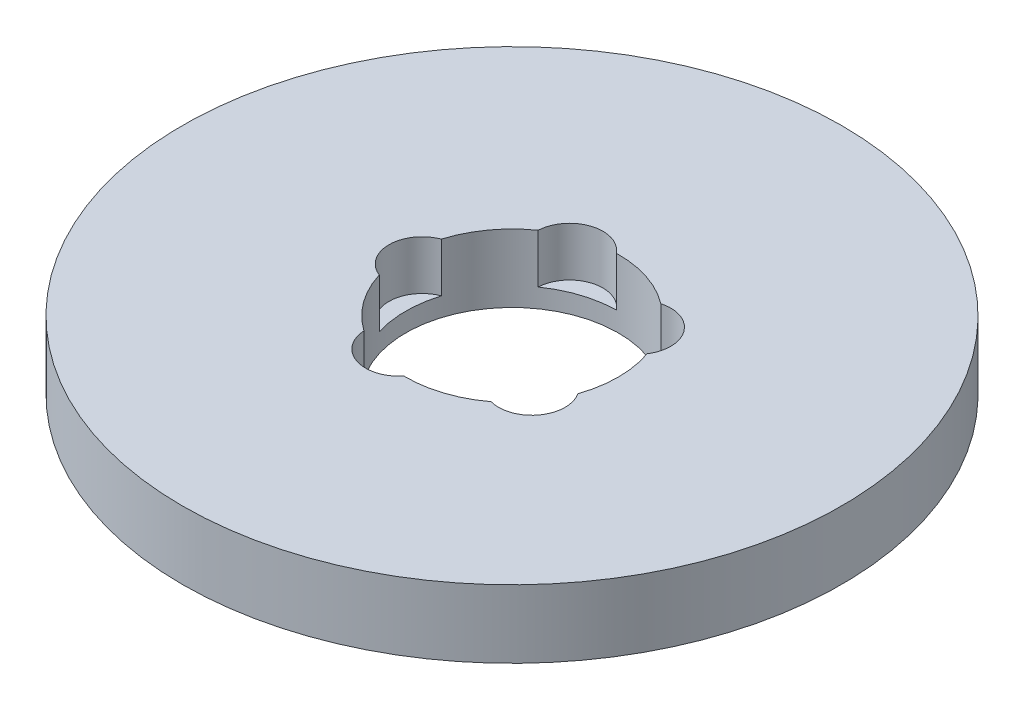
ISO-10303-21;
HEADER;
FILE_DESCRIPTION(('STEP AP214'),'2;1');
FILE_NAME('part.step','',(''),(''),'','','');
FILE_SCHEMA(('AUTOMOTIVE_DESIGN { 1 0 10303 214 1 1 1 1 }'));
ENDSEC;
DATA;
#1=APPLICATION_CONTEXT('core data for automotive mechanical design processes');
#2=APPLICATION_PROTOCOL_DEFINITION('international standard','automotive_design',2000,#1);
#3=PRODUCT_CONTEXT('',#1,'mechanical');
#4=PRODUCT('Part','Part','',(#3));
#5=PRODUCT_RELATED_PRODUCT_CATEGORY('part','',(#4));
#6=PRODUCT_DEFINITION_FORMATION('','',#4);
#7=PRODUCT_DEFINITION_CONTEXT('part definition',#1,'design');
#8=PRODUCT_DEFINITION('design','',#6,#7);
#9=PRODUCT_DEFINITION_SHAPE('','',#8);
#10=(LENGTH_UNIT() NAMED_UNIT(*) SI_UNIT(.MILLI.,.METRE.));
#11=(NAMED_UNIT(*) PLANE_ANGLE_UNIT() SI_UNIT($,.RADIAN.));
#12=(NAMED_UNIT(*) SI_UNIT($,.STERADIAN.) SOLID_ANGLE_UNIT());
#13=UNCERTAINTY_MEASURE_WITH_UNIT(LENGTH_MEASURE(1.E-05),#10,'distance_accuracy_value','');
#14=(GEOMETRIC_REPRESENTATION_CONTEXT(3) GLOBAL_UNCERTAINTY_ASSIGNED_CONTEXT((#13)) GLOBAL_UNIT_ASSIGNED_CONTEXT((#10,
#11,#12)) REPRESENTATION_CONTEXT('',''));
#15=CARTESIAN_POINT('',(0.,0.,0.));
#16=DIRECTION('',(0.,0.,1.));
#17=DIRECTION('',(1.,0.,0.));
#18=AXIS2_PLACEMENT_3D('',#15,#16,#17);
#19=CARTESIAN_POINT('',(0.,16.,0.));
#20=DIRECTION('',(0.,-1.,0.));
#21=DIRECTION('',(0.,0.,-1.));
#22=AXIS2_PLACEMENT_3D('',#19,#20,#21);
#23=CYLINDRICAL_SURFACE('',#22,77.5);
#24=CARTESIAN_POINT('',(0.,16.,0.));
#25=DIRECTION('',(0.,1.,0.));
#26=DIRECTION('',(0.,0.,1.));
#27=AXIS2_PLACEMENT_3D('',#24,#25,#26);
#28=CIRCLE('',#27,77.5);
#29=CARTESIAN_POINT('',(0.,16.,77.5));
#30=VERTEX_POINT('',#29);
#31=EDGE_CURVE('E151',#30,#30,#28,.T.);
#32=ORIENTED_EDGE('',*,*,#31,.F.);
#33=EDGE_LOOP('',(#32));
#34=FACE_BOUND('',#33,.T.);
#35=CARTESIAN_POINT('',(0.,0.,0.));
#36=DIRECTION('',(0.,1.,0.));
#37=DIRECTION('',(0.,0.,1.));
#38=AXIS2_PLACEMENT_3D('',#35,#36,#37);
#39=CIRCLE('',#38,77.5);
#40=CARTESIAN_POINT('',(0.,0.,77.5));
#41=VERTEX_POINT('',#40);
#42=EDGE_CURVE('E150',#41,#41,#39,.T.);
#43=ORIENTED_EDGE('',*,*,#42,.T.);
#44=EDGE_LOOP('',(#43));
#45=FACE_BOUND('',#44,.T.);
#46=ADVANCED_FACE('F39',(#34,#45),#23,.T.);
#47=CARTESIAN_POINT('',(0.,16.,0.));
#48=DIRECTION('',(0.,1.,0.));
#49=DIRECTION('',(0.,0.,1.));
#50=AXIS2_PLACEMENT_3D('',#47,#48,#49);
#51=PLANE('',#50);
#52=CARTESIAN_POINT('',(-6.52725455077584,16.,-20.0888238738743));
#53=DIRECTION('',(0.,1.,0.));
#54=DIRECTION('',(-0.95105651629515,0.,0.309016994374958));
#55=AXIS2_PLACEMENT_3D('',#52,#53,#54);
#56=CIRCLE('',#55,7.81487325369595);
#57=CARTESIAN_POINT('',(-0.445189525537201,16.,-24.9960358114312));
#58=VERTEX_POINT('',#57);
#59=CARTESIAN_POINT('',(-14.3321353238569,16.,-20.4838936010382));
#60=VERTEX_POINT('',#59);
#61=EDGE_CURVE('E196',#58,#60,#56,.T.);
#62=ORIENTED_EDGE('',*,*,#61,.F.);
#63=CARTESIAN_POINT('',(0.,16.,0.));
#64=DIRECTION('',(0.,1.,0.));
#65=DIRECTION('',(0.,0.,1.));
#66=AXIS2_PLACEMENT_3D('',#63,#64,#65);
#67=CIRCLE('',#66,25.);
#68=CARTESIAN_POINT('',(15.0524671076107,16.,-19.9605419258671));
#69=VERTEX_POINT('',#68);
#70=EDGE_CURVE('E156',#69,#58,#67,.T.);
#71=ORIENTED_EDGE('',*,*,#70,.F.);
#72=CARTESIAN_POINT('',(17.0885742671529,16.,-12.4155759480648));
#73=DIRECTION('',(0.,1.,0.));
#74=DIRECTION('',(-0.58778525229248,0.,-0.809016994374942));
#75=AXIS2_PLACEMENT_3D('',#72,#73,#74);
#76=CIRCLE('',#75,7.81487325369595);
#77=CARTESIAN_POINT('',(23.6350716109,16.,-8.14760025698547));
#78=VERTEX_POINT('',#77);
#79=EDGE_CURVE('E254',#78,#69,#76,.T.);
#80=ORIENTED_EDGE('',*,*,#79,.F.);
#81=CARTESIAN_POINT('',(23.6350716109001,16.,8.14760025698513));
#82=VERTEX_POINT('',#81);
#83=EDGE_CURVE('E153',#82,#78,#67,.T.);
#84=ORIENTED_EDGE('',*,*,#83,.F.);
#85=CARTESIAN_POINT('',(17.0885742671531,16.,12.4155759480646));
#86=DIRECTION('',(0.,1.,0.));
#87=DIRECTION('',(0.587785252292469,0.,-0.809016994374951));
#88=AXIS2_PLACEMENT_3D('',#85,#86,#87);
#89=CIRCLE('',#88,7.81487325369595);
#90=CARTESIAN_POINT('',(15.052467107611,16.,19.9605419258669));
#91=VERTEX_POINT('',#90);
#92=EDGE_CURVE('E248',#91,#82,#89,.T.);
#93=ORIENTED_EDGE('',*,*,#92,.F.);
#94=CARTESIAN_POINT('',(-0.445189525536845,16.,24.9960358114312));
#95=VERTEX_POINT('',#94);
#96=EDGE_CURVE('E140',#95,#91,#67,.T.);
#97=ORIENTED_EDGE('',*,*,#96,.F.);
#98=CARTESIAN_POINT('',(-6.52725455077556,16.,20.0888238738744));
#99=DIRECTION('',(0.,1.,0.));
#100=DIRECTION('',(0.951056516295155,0.,0.309016994374945));
#101=AXIS2_PLACEMENT_3D('',#98,#99,#100);
#102=CIRCLE('',#101,7.81487325369595);
#103=CARTESIAN_POINT('',(-14.3321353238567,16.,20.4838936010384));
#104=VERTEX_POINT('',#103);
#105=EDGE_CURVE('E117',#104,#95,#102,.T.);
#106=ORIENTED_EDGE('',*,*,#105,.F.);
#107=CARTESIAN_POINT('',(-23.9102138691173,16.,7.30079945848879));
#108=VERTEX_POINT('',#107);
#109=EDGE_CURVE('E133',#108,#104,#67,.T.);
#110=ORIENTED_EDGE('',*,*,#109,.F.);
#111=CARTESIAN_POINT('',(-21.1226394327547,16.,0.));
#112=DIRECTION('',(0.,1.,0.));
#113=DIRECTION('',(0.,0.,1.));
#114=AXIS2_PLACEMENT_3D('',#111,#112,#113);
#115=CIRCLE('',#114,7.81487325369595);
#116=CARTESIAN_POINT('',(-23.9102138691173,16.,-7.30079945848879));
#117=VERTEX_POINT('',#116);
#118=EDGE_CURVE('E170',#117,#108,#115,.T.);
#119=ORIENTED_EDGE('',*,*,#118,.F.);
#120=EDGE_CURVE('E149',#60,#117,#67,.T.);
#121=ORIENTED_EDGE('',*,*,#120,.F.);
#122=EDGE_LOOP('',(#62,#71,#80,#84,#93,#97,#106,#110,#119,#121));
#123=FACE_BOUND('',#122,.T.);
#124=ORIENTED_EDGE('',*,*,#31,.T.);
#125=EDGE_LOOP('',(#124));
#126=FACE_BOUND('',#125,.T.);
#127=ADVANCED_FACE('F131',(#123,#126),#51,.T.);
#128=CARTESIAN_POINT('',(0.,0.,0.));
#129=DIRECTION('',(0.,1.,0.));
#130=DIRECTION('',(0.,0.,1.));
#131=AXIS2_PLACEMENT_3D('',#128,#129,#130);
#132=PLANE('',#131);
#133=CARTESIAN_POINT('',(0.,0.,0.));
#134=DIRECTION('',(0.,1.,0.));
#135=DIRECTION('',(0.,0.,1.));
#136=AXIS2_PLACEMENT_3D('',#133,#134,#135);
#137=CIRCLE('',#136,25.);
#138=CARTESIAN_POINT('',(0.,0.,25.));
#139=VERTEX_POINT('',#138);
#140=EDGE_CURVE('E160',#139,#139,#137,.T.);
#141=ORIENTED_EDGE('',*,*,#140,.T.);
#142=EDGE_LOOP('',(#141));
#143=FACE_BOUND('',#142,.T.);
#144=ORIENTED_EDGE('',*,*,#42,.F.);
#145=EDGE_LOOP('',(#144));
#146=FACE_BOUND('',#145,.T.);
#147=ADVANCED_FACE('F212',(#143,#146),#132,.F.);
#148=CARTESIAN_POINT('',(0.,16.,0.));
#149=DIRECTION('',(0.,-1.,0.));
#150=DIRECTION('',(0.,0.,-1.));
#151=AXIS2_PLACEMENT_3D('',#148,#149,#150);
#152=CYLINDRICAL_SURFACE('',#151,25.);
#153=DIRECTION('',(0.,1.,0.));
#154=VECTOR('',#153,1.);
#155=CARTESIAN_POINT('',(-0.445189525537202,10.2204187529769,-24.9960358114312));
#156=LINE('',#155,#154);
#157=CARTESIAN_POINT('',(-0.445189525537201,4.44083750595388,-24.9960358114312));
#158=VERTEX_POINT('',#157);
#159=EDGE_CURVE('E11',#158,#58,#156,.T.);
#160=ORIENTED_EDGE('',*,*,#159,.F.);
#161=CARTESIAN_POINT('',(0.,4.44083750595388,0.));
#162=DIRECTION('',(0.,1.,0.));
#163=DIRECTION('',(0.,0.,1.));
#164=AXIS2_PLACEMENT_3D('',#161,#162,#163);
#165=CIRCLE('',#164,25.);
#166=CARTESIAN_POINT('',(-14.3321353238569,4.44083750595388,-20.4838936010382));
#167=VERTEX_POINT('',#166);
#168=EDGE_CURVE('E193',#158,#167,#165,.T.);
#169=ORIENTED_EDGE('',*,*,#168,.T.);
#170=DIRECTION('',(0.,1.,0.));
#171=VECTOR('',#170,1.);
#172=CARTESIAN_POINT('',(-14.3321353238569,10.2204187529769,-20.4838936010382));
#173=LINE('',#172,#171);
#174=EDGE_CURVE('E46',#60,#167,#173,.F.);
#175=ORIENTED_EDGE('',*,*,#174,.F.);
#176=ORIENTED_EDGE('',*,*,#120,.T.);
#177=DIRECTION('',(0.,1.,0.));
#178=VECTOR('',#177,1.);
#179=CARTESIAN_POINT('',(-23.9102138691173,10.2204187529769,-7.30079945848879));
#180=LINE('',#179,#178);
#181=CARTESIAN_POINT('',(-23.9102138691173,4.44083750595388,-7.30079945848879));
#182=VERTEX_POINT('',#181);
#183=EDGE_CURVE('E174',#182,#117,#180,.T.);
#184=ORIENTED_EDGE('',*,*,#183,.F.);
#185=CARTESIAN_POINT('',(0.,4.44083750595388,0.));
#186=DIRECTION('',(0.,1.,0.));
#187=DIRECTION('',(0.,0.,1.));
#188=AXIS2_PLACEMENT_3D('',#185,#186,#187);
#189=CIRCLE('',#188,25.);
#190=CARTESIAN_POINT('',(-23.9102138691173,4.44083750595388,7.30079945848879));
#191=VERTEX_POINT('',#190);
#192=EDGE_CURVE('E171',#182,#191,#189,.T.);
#193=ORIENTED_EDGE('',*,*,#192,.T.);
#194=DIRECTION('',(0.,1.,0.));
#195=VECTOR('',#194,1.);
#196=CARTESIAN_POINT('',(-23.9102138691173,10.2204187529769,7.30079945848879));
#197=LINE('',#196,#195);
#198=EDGE_CURVE('E148',#108,#191,#197,.F.);
#199=ORIENTED_EDGE('',*,*,#198,.F.);
#200=ORIENTED_EDGE('',*,*,#109,.T.);
#201=DIRECTION('',(0.,1.,0.));
#202=VECTOR('',#201,1.);
#203=CARTESIAN_POINT('',(-14.3321353238567,10.2204187529769,20.4838936010384));
#204=LINE('',#203,#202);
#205=CARTESIAN_POINT('',(-14.3321353238567,4.44083750595388,20.4838936010384));
#206=VERTEX_POINT('',#205);
#207=EDGE_CURVE('E111',#206,#104,#204,.T.);
#208=ORIENTED_EDGE('',*,*,#207,.F.);
#209=CARTESIAN_POINT('',(0.,4.44083750595388,0.));
#210=DIRECTION('',(0.,1.,0.));
#211=DIRECTION('',(0.,0.,1.));
#212=AXIS2_PLACEMENT_3D('',#209,#210,#211);
#213=CIRCLE('',#212,25.);
#214=CARTESIAN_POINT('',(-0.445189525536845,4.44083750595388,24.9960358114312));
#215=VERTEX_POINT('',#214);
#216=EDGE_CURVE('E180',#206,#215,#213,.T.);
#217=ORIENTED_EDGE('',*,*,#216,.T.);
#218=DIRECTION('',(0.,1.,0.));
#219=VECTOR('',#218,1.);
#220=CARTESIAN_POINT('',(-0.445189525536845,10.2204187529769,24.9960358114312));
#221=LINE('',#220,#219);
#222=EDGE_CURVE('E124',#95,#215,#221,.F.);
#223=ORIENTED_EDGE('',*,*,#222,.F.);
#224=ORIENTED_EDGE('',*,*,#96,.T.);
#225=DIRECTION('',(0.,1.,0.));
#226=VECTOR('',#225,1.);
#227=CARTESIAN_POINT('',(15.052467107611,10.2204187529769,19.9605419258669));
#228=LINE('',#227,#226);
#229=CARTESIAN_POINT('',(15.052467107611,4.44083750595388,19.9605419258669));
#230=VERTEX_POINT('',#229);
#231=EDGE_CURVE('E183',#230,#91,#228,.T.);
#232=ORIENTED_EDGE('',*,*,#231,.F.);
#233=CARTESIAN_POINT('',(0.,4.44083750595388,0.));
#234=DIRECTION('',(0.,1.,0.));
#235=DIRECTION('',(0.,0.,1.));
#236=AXIS2_PLACEMENT_3D('',#233,#234,#235);
#237=CIRCLE('',#236,25.);
#238=CARTESIAN_POINT('',(23.6350716109001,4.44083750595388,8.14760025698513));
#239=VERTEX_POINT('',#238);
#240=EDGE_CURVE('E123',#230,#239,#237,.T.);
#241=ORIENTED_EDGE('',*,*,#240,.T.);
#242=DIRECTION('',(0.,1.,0.));
#243=VECTOR('',#242,1.);
#244=CARTESIAN_POINT('',(23.6350716109001,10.2204187529769,8.14760025698513));
#245=LINE('',#244,#243);
#246=EDGE_CURVE('E185',#82,#239,#245,.F.);
#247=ORIENTED_EDGE('',*,*,#246,.F.);
#248=ORIENTED_EDGE('',*,*,#83,.T.);
#249=DIRECTION('',(0.,1.,0.));
#250=VECTOR('',#249,1.);
#251=CARTESIAN_POINT('',(23.6350716109,10.2204187529769,-8.14760025698547));
#252=LINE('',#251,#250);
#253=CARTESIAN_POINT('',(23.6350716109,4.44083750595388,-8.14760025698547));
#254=VERTEX_POINT('',#253);
#255=EDGE_CURVE('E195',#254,#78,#252,.T.);
#256=ORIENTED_EDGE('',*,*,#255,.F.);
#257=CARTESIAN_POINT('',(0.,4.44083750595388,0.));
#258=DIRECTION('',(0.,1.,0.));
#259=DIRECTION('',(0.,0.,1.));
#260=AXIS2_PLACEMENT_3D('',#257,#258,#259);
#261=CIRCLE('',#260,25.);
#262=CARTESIAN_POINT('',(15.0524671076107,4.44083750595388,-19.9605419258671));
#263=VERTEX_POINT('',#262);
#264=EDGE_CURVE('E190',#254,#263,#261,.T.);
#265=ORIENTED_EDGE('',*,*,#264,.T.);
#266=DIRECTION('',(0.,1.,0.));
#267=VECTOR('',#266,1.);
#268=CARTESIAN_POINT('',(15.0524671076107,10.2204187529769,-19.9605419258671));
#269=LINE('',#268,#267);
#270=EDGE_CURVE('E189',#69,#263,#269,.F.);
#271=ORIENTED_EDGE('',*,*,#270,.F.);
#272=ORIENTED_EDGE('',*,*,#70,.T.);
#273=EDGE_LOOP('',(#160,#169,#175,#176,#184,#193,#199,#200,#208,#217,#223,#224,#232,#241,#247,
#248,#256,#265,#271,#272));
#274=FACE_BOUND('',#273,.T.);
#275=ORIENTED_EDGE('',*,*,#140,.F.);
#276=EDGE_LOOP('',(#275));
#277=FACE_BOUND('',#276,.T.);
#278=ADVANCED_FACE('F142',(#274,#277),#152,.F.);
#279=CARTESIAN_POINT('',(-21.1226394327547,4.44083750595388,0.));
#280=DIRECTION('',(0.,1.,0.));
#281=DIRECTION('',(0.,0.,1.));
#282=AXIS2_PLACEMENT_3D('',#279,#280,#281);
#283=CYLINDRICAL_SURFACE('',#282,7.81487325369595);
#284=ORIENTED_EDGE('',*,*,#183,.T.);
#285=ORIENTED_EDGE('',*,*,#118,.T.);
#286=ORIENTED_EDGE('',*,*,#198,.T.);
#287=CARTESIAN_POINT('',(-21.1226394327547,4.44083750595388,0.));
#288=DIRECTION('',(0.,1.,0.));
#289=DIRECTION('',(0.,0.,1.));
#290=AXIS2_PLACEMENT_3D('',#287,#288,#289);
#291=CIRCLE('',#290,7.81487325369595);
#292=EDGE_CURVE('E163',#182,#191,#291,.T.);
#293=ORIENTED_EDGE('',*,*,#292,.F.);
#294=EDGE_LOOP('',(#284,#285,#286,#293));
#295=FACE_BOUND('',#294,.T.);
#296=ADVANCED_FACE('F221',(#295),#283,.F.);
#297=CARTESIAN_POINT('',(-21.1226394327547,4.44083750595388,0.));
#298=DIRECTION('',(0.,1.,0.));
#299=DIRECTION('',(0.,0.,1.));
#300=AXIS2_PLACEMENT_3D('',#297,#298,#299);
#301=PLANE('',#300);
#302=ORIENTED_EDGE('',*,*,#292,.T.);
#303=ORIENTED_EDGE('',*,*,#192,.F.);
#304=EDGE_LOOP('',(#302,#303));
#305=FACE_BOUND('',#304,.T.);
#306=ADVANCED_FACE('F227',(#305),#301,.T.);
#307=CARTESIAN_POINT('',(-6.52725455077556,4.44083750595388,20.0888238738744));
#308=DIRECTION('',(0.,1.,0.));
#309=DIRECTION('',(0.,0.,1.));
#310=AXIS2_PLACEMENT_3D('',#307,#308,#309);
#311=CYLINDRICAL_SURFACE('',#310,7.81487325369595);
#312=ORIENTED_EDGE('',*,*,#207,.T.);
#313=ORIENTED_EDGE('',*,*,#105,.T.);
#314=ORIENTED_EDGE('',*,*,#222,.T.);
#315=CARTESIAN_POINT('',(-6.52725455077556,4.44083750595388,20.0888238738744));
#316=DIRECTION('',(0.,1.,0.));
#317=DIRECTION('',(0.951056516295155,0.,0.309016994374945));
#318=AXIS2_PLACEMENT_3D('',#315,#316,#317);
#319=CIRCLE('',#318,7.81487325369595);
#320=EDGE_CURVE('E119',#206,#215,#319,.T.);
#321=ORIENTED_EDGE('',*,*,#320,.F.);
#322=EDGE_LOOP('',(#312,#313,#314,#321));
#323=FACE_BOUND('',#322,.T.);
#324=ADVANCED_FACE('F116',(#323),#311,.F.);
#325=CARTESIAN_POINT('',(-6.52725455077556,4.44083750595388,20.0888238738744));
#326=DIRECTION('',(0.,1.,0.));
#327=DIRECTION('',(0.951056516295155,0.,0.309016994374945));
#328=AXIS2_PLACEMENT_3D('',#325,#326,#327);
#329=PLANE('',#328);
#330=ORIENTED_EDGE('',*,*,#320,.T.);
#331=ORIENTED_EDGE('',*,*,#216,.F.);
#332=EDGE_LOOP('',(#330,#331));
#333=FACE_BOUND('',#332,.T.);
#334=ADVANCED_FACE('F234',(#333),#329,.T.);
#335=CARTESIAN_POINT('',(17.0885742671531,4.44083750595388,12.4155759480646));
#336=DIRECTION('',(0.,1.,0.));
#337=DIRECTION('',(0.,0.,1.));
#338=AXIS2_PLACEMENT_3D('',#335,#336,#337);
#339=CYLINDRICAL_SURFACE('',#338,7.81487325369595);
#340=ORIENTED_EDGE('',*,*,#231,.T.);
#341=ORIENTED_EDGE('',*,*,#92,.T.);
#342=ORIENTED_EDGE('',*,*,#246,.T.);
#343=CARTESIAN_POINT('',(17.0885742671531,4.44083750595388,12.4155759480646));
#344=DIRECTION('',(0.,1.,0.));
#345=DIRECTION('',(0.587785252292469,0.,-0.809016994374951));
#346=AXIS2_PLACEMENT_3D('',#343,#344,#345);
#347=CIRCLE('',#346,7.81487325369595);
#348=EDGE_CURVE('E137',#230,#239,#347,.T.);
#349=ORIENTED_EDGE('',*,*,#348,.F.);
#350=EDGE_LOOP('',(#340,#341,#342,#349));
#351=FACE_BOUND('',#350,.T.);
#352=ADVANCED_FACE('F240',(#351),#339,.F.);
#353=CARTESIAN_POINT('',(17.0885742671531,4.44083750595388,12.4155759480646));
#354=DIRECTION('',(0.,1.,0.));
#355=DIRECTION('',(0.587785252292469,0.,-0.809016994374951));
#356=AXIS2_PLACEMENT_3D('',#353,#354,#355);
#357=PLANE('',#356);
#358=ORIENTED_EDGE('',*,*,#348,.T.);
#359=ORIENTED_EDGE('',*,*,#240,.F.);
#360=EDGE_LOOP('',(#358,#359));
#361=FACE_BOUND('',#360,.T.);
#362=ADVANCED_FACE('F245',(#361),#357,.T.);
#363=CARTESIAN_POINT('',(17.0885742671529,4.44083750595388,-12.4155759480648));
#364=DIRECTION('',(0.,1.,0.));
#365=DIRECTION('',(0.,0.,1.));
#366=AXIS2_PLACEMENT_3D('',#363,#364,#365);
#367=CYLINDRICAL_SURFACE('',#366,7.81487325369595);
#368=ORIENTED_EDGE('',*,*,#255,.T.);
#369=ORIENTED_EDGE('',*,*,#79,.T.);
#370=ORIENTED_EDGE('',*,*,#270,.T.);
#371=CARTESIAN_POINT('',(17.0885742671529,4.44083750595388,-12.4155759480648));
#372=DIRECTION('',(0.,1.,0.));
#373=DIRECTION('',(-0.58778525229248,0.,-0.809016994374942));
#374=AXIS2_PLACEMENT_3D('',#371,#372,#373);
#375=CIRCLE('',#374,7.81487325369595);
#376=EDGE_CURVE('E56',#254,#263,#375,.T.);
#377=ORIENTED_EDGE('',*,*,#376,.F.);
#378=EDGE_LOOP('',(#368,#369,#370,#377));
#379=FACE_BOUND('',#378,.T.);
#380=ADVANCED_FACE('F264',(#379),#367,.F.);
#381=CARTESIAN_POINT('',(17.0885742671529,4.44083750595388,-12.4155759480648));
#382=DIRECTION('',(0.,1.,0.));
#383=DIRECTION('',(-0.58778525229248,0.,-0.809016994374942));
#384=AXIS2_PLACEMENT_3D('',#381,#382,#383);
#385=PLANE('',#384);
#386=ORIENTED_EDGE('',*,*,#376,.T.);
#387=ORIENTED_EDGE('',*,*,#264,.F.);
#388=EDGE_LOOP('',(#386,#387));
#389=FACE_BOUND('',#388,.T.);
#390=ADVANCED_FACE('F202',(#389),#385,.T.);
#391=CARTESIAN_POINT('',(-6.52725455077584,4.44083750595388,-20.0888238738743));
#392=DIRECTION('',(0.,1.,0.));
#393=DIRECTION('',(0.,0.,1.));
#394=AXIS2_PLACEMENT_3D('',#391,#392,#393);
#395=CYLINDRICAL_SURFACE('',#394,7.81487325369595);
#396=ORIENTED_EDGE('',*,*,#159,.T.);
#397=ORIENTED_EDGE('',*,*,#61,.T.);
#398=ORIENTED_EDGE('',*,*,#174,.T.);
#399=CARTESIAN_POINT('',(-6.52725455077584,4.44083750595388,-20.0888238738743));
#400=DIRECTION('',(0.,1.,0.));
#401=DIRECTION('',(-0.95105651629515,0.,0.309016994374958));
#402=AXIS2_PLACEMENT_3D('',#399,#400,#401);
#403=CIRCLE('',#402,7.81487325369595);
#404=EDGE_CURVE('E55',#158,#167,#403,.T.);
#405=ORIENTED_EDGE('',*,*,#404,.F.);
#406=EDGE_LOOP('',(#396,#397,#398,#405));
#407=FACE_BOUND('',#406,.T.);
#408=ADVANCED_FACE('F197',(#407),#395,.F.);
#409=CARTESIAN_POINT('',(-6.52725455077584,4.44083750595388,-20.0888238738743));
#410=DIRECTION('',(0.,1.,0.));
#411=DIRECTION('',(-0.95105651629515,0.,0.309016994374958));
#412=AXIS2_PLACEMENT_3D('',#409,#410,#411);
#413=PLANE('',#412);
#414=ORIENTED_EDGE('',*,*,#404,.T.);
#415=ORIENTED_EDGE('',*,*,#168,.F.);
#416=EDGE_LOOP('',(#414,#415));
#417=FACE_BOUND('',#416,.T.);
#418=ADVANCED_FACE('F200',(#417),#413,.T.);
#419=CLOSED_SHELL('',(#46,#127,#147,#278,#296,#306,#324,#334,#352,#362,#380,#390,#408,#418));
#420=MANIFOLD_SOLID_BREP('B2',#419);
#421=ADVANCED_BREP_SHAPE_REPRESENTATION('',(#18,#420),#14);
#422=SHAPE_DEFINITION_REPRESENTATION(#9,#421);
ENDSEC;
END-ISO-10303-21;
